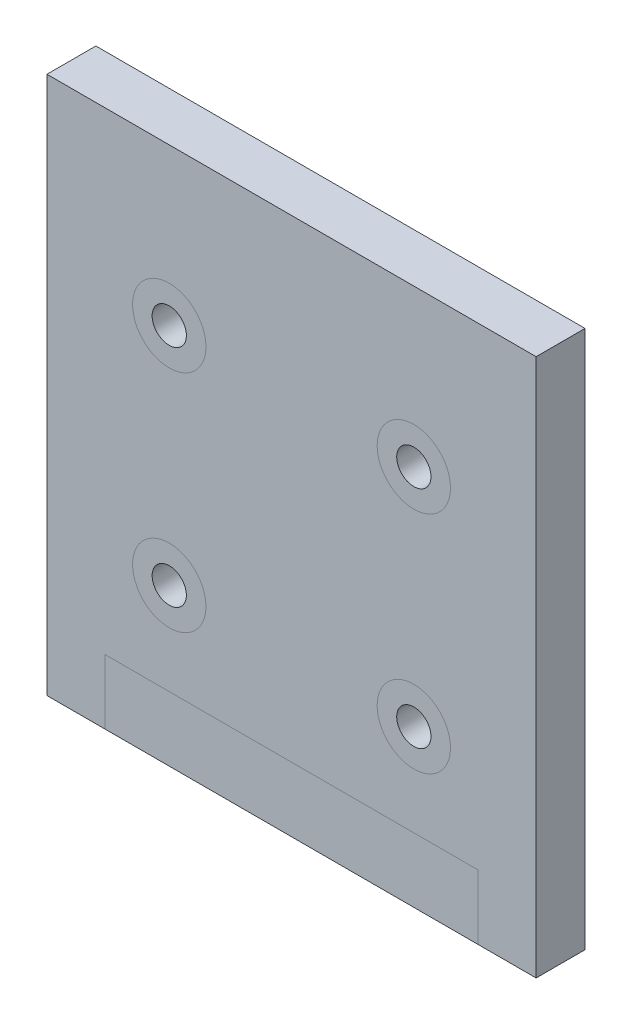
ISO-10303-21;
HEADER;
FILE_DESCRIPTION(('STEP AP214'),'2;1');
FILE_NAME('part.step','',(''),(''),'','','');
FILE_SCHEMA(('AUTOMOTIVE_DESIGN { 1 0 10303 214 1 1 1 1 }'));
ENDSEC;
DATA;
#1=APPLICATION_CONTEXT('core data for automotive mechanical design processes');
#2=APPLICATION_PROTOCOL_DEFINITION('international standard','automotive_design',2000,#1);
#3=PRODUCT_CONTEXT('',#1,'mechanical');
#4=PRODUCT('Part','Part','',(#3));
#5=PRODUCT_RELATED_PRODUCT_CATEGORY('part','',(#4));
#6=PRODUCT_DEFINITION_FORMATION('','',#4);
#7=PRODUCT_DEFINITION_CONTEXT('part definition',#1,'design');
#8=PRODUCT_DEFINITION('design','',#6,#7);
#9=PRODUCT_DEFINITION_SHAPE('','',#8);
#10=(LENGTH_UNIT() NAMED_UNIT(*) SI_UNIT(.MILLI.,.METRE.));
#11=(NAMED_UNIT(*) PLANE_ANGLE_UNIT() SI_UNIT($,.RADIAN.));
#12=(NAMED_UNIT(*) SI_UNIT($,.STERADIAN.) SOLID_ANGLE_UNIT());
#13=UNCERTAINTY_MEASURE_WITH_UNIT(LENGTH_MEASURE(1.E-05),#10,'distance_accuracy_value','');
#14=(GEOMETRIC_REPRESENTATION_CONTEXT(3) GLOBAL_UNCERTAINTY_ASSIGNED_CONTEXT((#13)) GLOBAL_UNIT_ASSIGNED_CONTEXT((#10,
#11,#12)) REPRESENTATION_CONTEXT('',''));
#15=CARTESIAN_POINT('',(0.,0.,0.));
#16=DIRECTION('',(0.,0.,1.));
#17=DIRECTION('',(1.,0.,0.));
#18=AXIS2_PLACEMENT_3D('',#15,#16,#17);
#19=CARTESIAN_POINT('',(0.,139.7,12.7));
#20=DIRECTION('',(0.,0.,-1.));
#21=DIRECTION('',(-1.,0.,0.));
#22=AXIS2_PLACEMENT_3D('',#19,#20,#21);
#23=PLANE('',#22);
#24=CARTESIAN_POINT('',(31.75,40.64,12.7));
#25=DIRECTION('',(0.,0.,-1.));
#26=DIRECTION('',(-1.,0.,0.));
#27=AXIS2_PLACEMENT_3D('',#24,#25,#26);
#28=CIRCLE('',#27,9.525);
#29=CARTESIAN_POINT('',(22.225,40.64,12.7));
#30=VERTEX_POINT('',#29);
#31=EDGE_CURVE('E51',#30,#30,#28,.F.);
#32=ORIENTED_EDGE('',*,*,#31,.F.);
#33=EDGE_LOOP('',(#32));
#34=FACE_BOUND('',#33,.T.);
#35=CARTESIAN_POINT('',(31.7499999999998,99.06,12.7));
#36=DIRECTION('',(0.,0.,-1.));
#37=DIRECTION('',(-1.,0.,0.));
#38=AXIS2_PLACEMENT_3D('',#35,#36,#37);
#39=CIRCLE('',#38,9.525);
#40=CARTESIAN_POINT('',(22.2249999999998,99.06,12.7));
#41=VERTEX_POINT('',#40);
#42=EDGE_CURVE('E152',#41,#41,#39,.F.);
#43=ORIENTED_EDGE('',*,*,#42,.F.);
#44=EDGE_LOOP('',(#43));
#45=FACE_BOUND('',#44,.T.);
#46=DIRECTION('',(0.,-1.,0.));
#47=VECTOR('',#46,1.);
#48=CARTESIAN_POINT('',(15.113,139.7,12.7));
#49=LINE('',#48,#47);
#50=CARTESIAN_POINT('',(15.113,16.764,12.7));
#51=VERTEX_POINT('',#50);
#52=CARTESIAN_POINT('',(15.113,0.,12.7));
#53=VERTEX_POINT('',#52);
#54=EDGE_CURVE('E58',#51,#53,#49,.T.);
#55=ORIENTED_EDGE('',*,*,#54,.F.);
#56=DIRECTION('',(-1.,0.,0.));
#57=VECTOR('',#56,1.);
#58=CARTESIAN_POINT('',(0.,16.764,12.7));
#59=LINE('',#58,#57);
#60=CARTESIAN_POINT('',(111.887,16.764,12.7));
#61=VERTEX_POINT('',#60);
#62=EDGE_CURVE('E116',#61,#51,#59,.T.);
#63=ORIENTED_EDGE('',*,*,#62,.F.);
#64=DIRECTION('',(0.,1.,0.));
#65=VECTOR('',#64,1.);
#66=CARTESIAN_POINT('',(111.887,139.7,12.7));
#67=LINE('',#66,#65);
#68=CARTESIAN_POINT('',(111.887,0.,12.7));
#69=VERTEX_POINT('',#68);
#70=EDGE_CURVE('E65',#69,#61,#67,.T.);
#71=ORIENTED_EDGE('',*,*,#70,.F.);
#72=DIRECTION('',(1.,0.,0.));
#73=VECTOR('',#72,1.);
#74=CARTESIAN_POINT('',(0.,0.,12.7));
#75=LINE('',#74,#73);
#76=CARTESIAN_POINT('',(127.,0.,12.7));
#77=VERTEX_POINT('',#76);
#78=EDGE_CURVE('E134',#69,#77,#75,.T.);
#79=ORIENTED_EDGE('',*,*,#78,.T.);
#80=DIRECTION('',(0.,1.,0.));
#81=VECTOR('',#80,1.);
#82=CARTESIAN_POINT('',(127.,0.,12.7));
#83=LINE('',#82,#81);
#84=CARTESIAN_POINT('',(127.,139.7,12.7));
#85=VERTEX_POINT('',#84);
#86=EDGE_CURVE('E136',#77,#85,#83,.T.);
#87=ORIENTED_EDGE('',*,*,#86,.T.);
#88=DIRECTION('',(-1.,0.,0.));
#89=VECTOR('',#88,1.);
#90=CARTESIAN_POINT('',(0.,139.7,12.7));
#91=LINE('',#90,#89);
#92=CARTESIAN_POINT('',(0.,139.7,12.7));
#93=VERTEX_POINT('',#92);
#94=EDGE_CURVE('E139',#85,#93,#91,.T.);
#95=ORIENTED_EDGE('',*,*,#94,.T.);
#96=DIRECTION('',(0.,-1.,0.));
#97=VECTOR('',#96,1.);
#98=CARTESIAN_POINT('',(0.,0.,12.7));
#99=LINE('',#98,#97);
#100=CARTESIAN_POINT('',(0.,0.,12.7));
#101=VERTEX_POINT('',#100);
#102=EDGE_CURVE('E132',#93,#101,#99,.T.);
#103=ORIENTED_EDGE('',*,*,#102,.T.);
#104=EDGE_CURVE('E112',#101,#53,#75,.T.);
#105=ORIENTED_EDGE('',*,*,#104,.T.);
#106=EDGE_LOOP('',(#55,#63,#71,#79,#87,#95,#103,#105));
#107=FACE_BOUND('',#106,.T.);
#108=CARTESIAN_POINT('',(95.2499999999998,99.06,12.7));
#109=DIRECTION('',(0.,0.,-1.));
#110=DIRECTION('',(-1.,0.,0.));
#111=AXIS2_PLACEMENT_3D('',#108,#109,#110);
#112=CIRCLE('',#111,9.52500000000001);
#113=CARTESIAN_POINT('',(85.7249999999998,99.06,12.7));
#114=VERTEX_POINT('',#113);
#115=EDGE_CURVE('E156',#114,#114,#112,.F.);
#116=ORIENTED_EDGE('',*,*,#115,.F.);
#117=EDGE_LOOP('',(#116));
#118=FACE_BOUND('',#117,.T.);
#119=CARTESIAN_POINT('',(95.25,40.64,12.7));
#120=DIRECTION('',(0.,0.,-1.));
#121=DIRECTION('',(-1.,0.,0.));
#122=AXIS2_PLACEMENT_3D('',#119,#120,#121);
#123=CIRCLE('',#122,9.52500000000001);
#124=CARTESIAN_POINT('',(85.725,40.64,12.7));
#125=VERTEX_POINT('',#124);
#126=EDGE_CURVE('E11',#125,#125,#123,.F.);
#127=ORIENTED_EDGE('',*,*,#126,.F.);
#128=EDGE_LOOP('',(#127));
#129=FACE_BOUND('',#128,.T.);
#130=ADVANCED_FACE('F42',(#34,#45,#107,#118,#129),#23,.F.);
#131=ORIENTED_EDGE('',*,*,#126,.T.);
#132=EDGE_LOOP('',(#131));
#133=FACE_BOUND('',#132,.T.);
#134=CARTESIAN_POINT('',(95.25,40.64,12.7));
#135=DIRECTION('',(0.,0.,1.));
#136=DIRECTION('',(1.,0.,0.));
#137=AXIS2_PLACEMENT_3D('',#134,#135,#136);
#138=CIRCLE('',#137,4.445);
#139=CARTESIAN_POINT('',(99.695,40.64,12.7));
#140=VERTEX_POINT('',#139);
#141=EDGE_CURVE('E183',#140,#140,#138,.T.);
#142=ORIENTED_EDGE('',*,*,#141,.F.);
#143=EDGE_LOOP('',(#142));
#144=FACE_BOUND('',#143,.T.);
#145=ADVANCED_FACE('F170',(#133,#144),#23,.F.);
#146=ORIENTED_EDGE('',*,*,#31,.T.);
#147=EDGE_LOOP('',(#146));
#148=FACE_BOUND('',#147,.T.);
#149=CARTESIAN_POINT('',(31.75,40.64,12.7));
#150=DIRECTION('',(0.,0.,1.));
#151=DIRECTION('',(1.,0.,0.));
#152=AXIS2_PLACEMENT_3D('',#149,#150,#151);
#153=CIRCLE('',#152,4.445);
#154=CARTESIAN_POINT('',(36.195,40.64,12.7));
#155=VERTEX_POINT('',#154);
#156=EDGE_CURVE('E122',#155,#155,#153,.T.);
#157=ORIENTED_EDGE('',*,*,#156,.F.);
#158=EDGE_LOOP('',(#157));
#159=FACE_BOUND('',#158,.T.);
#160=ADVANCED_FACE('F165',(#148,#159),#23,.F.);
#161=ORIENTED_EDGE('',*,*,#115,.T.);
#162=EDGE_LOOP('',(#161));
#163=FACE_BOUND('',#162,.T.);
#164=CARTESIAN_POINT('',(95.2499999999998,99.06,12.7));
#165=DIRECTION('',(0.,0.,1.));
#166=DIRECTION('',(1.,0.,0.));
#167=AXIS2_PLACEMENT_3D('',#164,#165,#166);
#168=CIRCLE('',#167,4.44499999999999);
#169=CARTESIAN_POINT('',(99.6949999999998,99.06,12.7));
#170=VERTEX_POINT('',#169);
#171=EDGE_CURVE('E197',#170,#170,#168,.T.);
#172=ORIENTED_EDGE('',*,*,#171,.F.);
#173=EDGE_LOOP('',(#172));
#174=FACE_BOUND('',#173,.T.);
#175=ADVANCED_FACE('F255',(#163,#174),#23,.F.);
#176=ORIENTED_EDGE('',*,*,#42,.T.);
#177=EDGE_LOOP('',(#176));
#178=FACE_BOUND('',#177,.T.);
#179=CARTESIAN_POINT('',(31.7499999999998,99.06,12.7));
#180=DIRECTION('',(0.,0.,1.));
#181=DIRECTION('',(1.,0.,0.));
#182=AXIS2_PLACEMENT_3D('',#179,#180,#181);
#183=CIRCLE('',#182,4.445);
#184=CARTESIAN_POINT('',(36.1949999999998,99.06,12.7));
#185=VERTEX_POINT('',#184);
#186=EDGE_CURVE('E189',#185,#185,#183,.T.);
#187=ORIENTED_EDGE('',*,*,#186,.F.);
#188=EDGE_LOOP('',(#187));
#189=FACE_BOUND('',#188,.T.);
#190=ADVANCED_FACE('F228',(#178,#189),#23,.F.);
#191=ORIENTED_EDGE('',*,*,#62,.T.);
#192=ORIENTED_EDGE('',*,*,#54,.T.);
#193=EDGE_CURVE('E137',#53,#69,#75,.T.);
#194=ORIENTED_EDGE('',*,*,#193,.T.);
#195=ORIENTED_EDGE('',*,*,#70,.T.);
#196=EDGE_LOOP('',(#191,#192,#194,#195));
#197=FACE_BOUND('',#196,.T.);
#198=ADVANCED_FACE('F172',(#197),#23,.F.);
#199=CARTESIAN_POINT('',(0.,139.7,0.));
#200=DIRECTION('',(0.,0.,-1.));
#201=DIRECTION('',(-1.,0.,0.));
#202=AXIS2_PLACEMENT_3D('',#199,#200,#201);
#203=PLANE('',#202);
#204=CARTESIAN_POINT('',(31.7499999999998,99.06,0.));
#205=DIRECTION('',(0.,0.,1.));
#206=DIRECTION('',(1.,0.,0.));
#207=AXIS2_PLACEMENT_3D('',#204,#205,#206);
#208=CIRCLE('',#207,4.445);
#209=CARTESIAN_POINT('',(36.1949999999998,99.06,0.));
#210=VERTEX_POINT('',#209);
#211=EDGE_CURVE('E194',#210,#210,#208,.T.);
#212=ORIENTED_EDGE('',*,*,#211,.T.);
#213=EDGE_LOOP('',(#212));
#214=FACE_BOUND('',#213,.T.);
#215=CARTESIAN_POINT('',(31.75,40.64,0.));
#216=DIRECTION('',(0.,0.,1.));
#217=DIRECTION('',(1.,0.,0.));
#218=AXIS2_PLACEMENT_3D('',#215,#216,#217);
#219=CIRCLE('',#218,4.445);
#220=CARTESIAN_POINT('',(36.195,40.64,0.));
#221=VERTEX_POINT('',#220);
#222=EDGE_CURVE('E125',#221,#221,#219,.T.);
#223=ORIENTED_EDGE('',*,*,#222,.T.);
#224=EDGE_LOOP('',(#223));
#225=FACE_BOUND('',#224,.T.);
#226=DIRECTION('',(0.,-1.,0.));
#227=VECTOR('',#226,1.);
#228=CARTESIAN_POINT('',(0.,0.,0.));
#229=LINE('',#228,#227);
#230=CARTESIAN_POINT('',(0.,139.7,0.));
#231=VERTEX_POINT('',#230);
#232=CARTESIAN_POINT('',(0.,0.,0.));
#233=VERTEX_POINT('',#232);
#234=EDGE_CURVE('E102',#231,#233,#229,.T.);
#235=ORIENTED_EDGE('',*,*,#234,.F.);
#236=DIRECTION('',(-1.,0.,0.));
#237=VECTOR('',#236,1.);
#238=CARTESIAN_POINT('',(0.,139.7,0.));
#239=LINE('',#238,#237);
#240=CARTESIAN_POINT('',(127.,139.7,0.));
#241=VERTEX_POINT('',#240);
#242=EDGE_CURVE('E130',#241,#231,#239,.T.);
#243=ORIENTED_EDGE('',*,*,#242,.F.);
#244=DIRECTION('',(0.,1.,0.));
#245=VECTOR('',#244,1.);
#246=CARTESIAN_POINT('',(127.,0.,0.));
#247=LINE('',#246,#245);
#248=CARTESIAN_POINT('',(127.,0.,0.));
#249=VERTEX_POINT('',#248);
#250=EDGE_CURVE('E103',#249,#241,#247,.T.);
#251=ORIENTED_EDGE('',*,*,#250,.F.);
#252=DIRECTION('',(1.,0.,0.));
#253=VECTOR('',#252,1.);
#254=CARTESIAN_POINT('',(0.,0.,0.));
#255=LINE('',#254,#253);
#256=EDGE_CURVE('E96',#233,#249,#255,.T.);
#257=ORIENTED_EDGE('',*,*,#256,.F.);
#258=EDGE_LOOP('',(#235,#243,#251,#257));
#259=FACE_BOUND('',#258,.T.);
#260=CARTESIAN_POINT('',(95.25,40.64,0.));
#261=DIRECTION('',(0.,0.,1.));
#262=DIRECTION('',(1.,0.,0.));
#263=AXIS2_PLACEMENT_3D('',#260,#261,#262);
#264=CIRCLE('',#263,4.445);
#265=CARTESIAN_POINT('',(99.695,40.64,0.));
#266=VERTEX_POINT('',#265);
#267=EDGE_CURVE('E185',#266,#266,#264,.T.);
#268=ORIENTED_EDGE('',*,*,#267,.T.);
#269=EDGE_LOOP('',(#268));
#270=FACE_BOUND('',#269,.T.);
#271=CARTESIAN_POINT('',(95.2499999999998,99.06,0.));
#272=DIRECTION('',(0.,0.,1.));
#273=DIRECTION('',(1.,0.,0.));
#274=AXIS2_PLACEMENT_3D('',#271,#272,#273);
#275=CIRCLE('',#274,4.44499999999999);
#276=CARTESIAN_POINT('',(99.6949999999998,99.06,0.));
#277=VERTEX_POINT('',#276);
#278=EDGE_CURVE('E200',#277,#277,#275,.T.);
#279=ORIENTED_EDGE('',*,*,#278,.T.);
#280=EDGE_LOOP('',(#279));
#281=FACE_BOUND('',#280,.T.);
#282=ADVANCED_FACE('F98',(#214,#225,#259,#270,#281),#203,.T.);
#283=CARTESIAN_POINT('',(0.,0.,12.7));
#284=DIRECTION('',(1.,0.,0.));
#285=DIRECTION('',(0.,0.,-1.));
#286=AXIS2_PLACEMENT_3D('',#283,#284,#285);
#287=PLANE('',#286);
#288=ORIENTED_EDGE('',*,*,#234,.T.);
#289=DIRECTION('',(0.,0.,-1.));
#290=VECTOR('',#289,1.);
#291=CARTESIAN_POINT('',(0.,0.,12.7));
#292=LINE('',#291,#290);
#293=EDGE_CURVE('E109',#101,#233,#292,.T.);
#294=ORIENTED_EDGE('',*,*,#293,.F.);
#295=ORIENTED_EDGE('',*,*,#102,.F.);
#296=DIRECTION('',(0.,0.,-1.));
#297=VECTOR('',#296,1.);
#298=CARTESIAN_POINT('',(0.,139.7,12.7));
#299=LINE('',#298,#297);
#300=EDGE_CURVE('E121',#93,#231,#299,.T.);
#301=ORIENTED_EDGE('',*,*,#300,.T.);
#302=EDGE_LOOP('',(#288,#294,#295,#301));
#303=FACE_BOUND('',#302,.T.);
#304=ADVANCED_FACE('F44',(#303),#287,.F.);
#305=CARTESIAN_POINT('',(0.,0.,12.7));
#306=DIRECTION('',(0.,1.,0.));
#307=DIRECTION('',(0.,0.,1.));
#308=AXIS2_PLACEMENT_3D('',#305,#306,#307);
#309=PLANE('',#308);
#310=ORIENTED_EDGE('',*,*,#256,.T.);
#311=DIRECTION('',(0.,0.,-1.));
#312=VECTOR('',#311,1.);
#313=CARTESIAN_POINT('',(127.,0.,12.7));
#314=LINE('',#313,#312);
#315=EDGE_CURVE('E117',#77,#249,#314,.T.);
#316=ORIENTED_EDGE('',*,*,#315,.F.);
#317=ORIENTED_EDGE('',*,*,#78,.F.);
#318=ORIENTED_EDGE('',*,*,#193,.F.);
#319=ORIENTED_EDGE('',*,*,#104,.F.);
#320=ORIENTED_EDGE('',*,*,#293,.T.);
#321=EDGE_LOOP('',(#310,#316,#317,#318,#319,#320));
#322=FACE_BOUND('',#321,.T.);
#323=ADVANCED_FACE('F110',(#322),#309,.F.);
#324=CARTESIAN_POINT('',(127.,0.,12.7));
#325=DIRECTION('',(-1.,0.,0.));
#326=DIRECTION('',(0.,0.,1.));
#327=AXIS2_PLACEMENT_3D('',#324,#325,#326);
#328=PLANE('',#327);
#329=ORIENTED_EDGE('',*,*,#250,.T.);
#330=DIRECTION('',(0.,0.,-1.));
#331=VECTOR('',#330,1.);
#332=CARTESIAN_POINT('',(127.,139.7,12.7));
#333=LINE('',#332,#331);
#334=EDGE_CURVE('E142',#85,#241,#333,.T.);
#335=ORIENTED_EDGE('',*,*,#334,.F.);
#336=ORIENTED_EDGE('',*,*,#86,.F.);
#337=ORIENTED_EDGE('',*,*,#315,.T.);
#338=EDGE_LOOP('',(#329,#335,#336,#337));
#339=FACE_BOUND('',#338,.T.);
#340=ADVANCED_FACE('F231',(#339),#328,.F.);
#341=CARTESIAN_POINT('',(0.,139.7,12.7));
#342=DIRECTION('',(0.,-1.,0.));
#343=DIRECTION('',(0.,0.,-1.));
#344=AXIS2_PLACEMENT_3D('',#341,#342,#343);
#345=PLANE('',#344);
#346=ORIENTED_EDGE('',*,*,#242,.T.);
#347=ORIENTED_EDGE('',*,*,#300,.F.);
#348=ORIENTED_EDGE('',*,*,#94,.F.);
#349=ORIENTED_EDGE('',*,*,#334,.T.);
#350=EDGE_LOOP('',(#346,#347,#348,#349));
#351=FACE_BOUND('',#350,.T.);
#352=ADVANCED_FACE('F222',(#351),#345,.F.);
#353=CARTESIAN_POINT('',(31.75,40.64,12.7));
#354=DIRECTION('',(0.,0.,-1.));
#355=DIRECTION('',(-1.,0.,0.));
#356=AXIS2_PLACEMENT_3D('',#353,#354,#355);
#357=CYLINDRICAL_SURFACE('',#356,4.445);
#358=ORIENTED_EDGE('',*,*,#156,.T.);
#359=EDGE_LOOP('',(#358));
#360=FACE_BOUND('',#359,.T.);
#361=ORIENTED_EDGE('',*,*,#222,.F.);
#362=EDGE_LOOP('',(#361));
#363=FACE_BOUND('',#362,.T.);
#364=ADVANCED_FACE('F219',(#360,#363),#357,.F.);
#365=CARTESIAN_POINT('',(95.25,40.64,12.7));
#366=DIRECTION('',(0.,0.,-1.));
#367=DIRECTION('',(-1.,0.,0.));
#368=AXIS2_PLACEMENT_3D('',#365,#366,#367);
#369=CYLINDRICAL_SURFACE('',#368,4.445);
#370=ORIENTED_EDGE('',*,*,#141,.T.);
#371=EDGE_LOOP('',(#370));
#372=FACE_BOUND('',#371,.T.);
#373=ORIENTED_EDGE('',*,*,#267,.F.);
#374=EDGE_LOOP('',(#373));
#375=FACE_BOUND('',#374,.T.);
#376=ADVANCED_FACE('F213',(#372,#375),#369,.F.);
#377=CARTESIAN_POINT('',(31.7499999999998,99.06,12.7));
#378=DIRECTION('',(0.,0.,-1.));
#379=DIRECTION('',(-1.,0.,0.));
#380=AXIS2_PLACEMENT_3D('',#377,#378,#379);
#381=CYLINDRICAL_SURFACE('',#380,4.445);
#382=ORIENTED_EDGE('',*,*,#186,.T.);
#383=EDGE_LOOP('',(#382));
#384=FACE_BOUND('',#383,.T.);
#385=ORIENTED_EDGE('',*,*,#211,.F.);
#386=EDGE_LOOP('',(#385));
#387=FACE_BOUND('',#386,.T.);
#388=ADVANCED_FACE('F207',(#384,#387),#381,.F.);
#389=CARTESIAN_POINT('',(95.2499999999998,99.06,12.7));
#390=DIRECTION('',(0.,0.,-1.));
#391=DIRECTION('',(-1.,0.,0.));
#392=AXIS2_PLACEMENT_3D('',#389,#390,#391);
#393=CYLINDRICAL_SURFACE('',#392,4.44499999999999);
#394=ORIENTED_EDGE('',*,*,#171,.T.);
#395=EDGE_LOOP('',(#394));
#396=FACE_BOUND('',#395,.T.);
#397=ORIENTED_EDGE('',*,*,#278,.F.);
#398=EDGE_LOOP('',(#397));
#399=FACE_BOUND('',#398,.T.);
#400=ADVANCED_FACE('F205',(#396,#399),#393,.F.);
#401=CLOSED_SHELL('',(#130,#145,#160,#175,#190,#198,#282,#304,#323,#340,#352,#364,#376,#388,#400));
#402=MANIFOLD_SOLID_BREP('B2',#401);
#403=ADVANCED_BREP_SHAPE_REPRESENTATION('',(#18,#402),#14);
#404=SHAPE_DEFINITION_REPRESENTATION(#9,#403);
ENDSEC;
END-ISO-10303-21;
